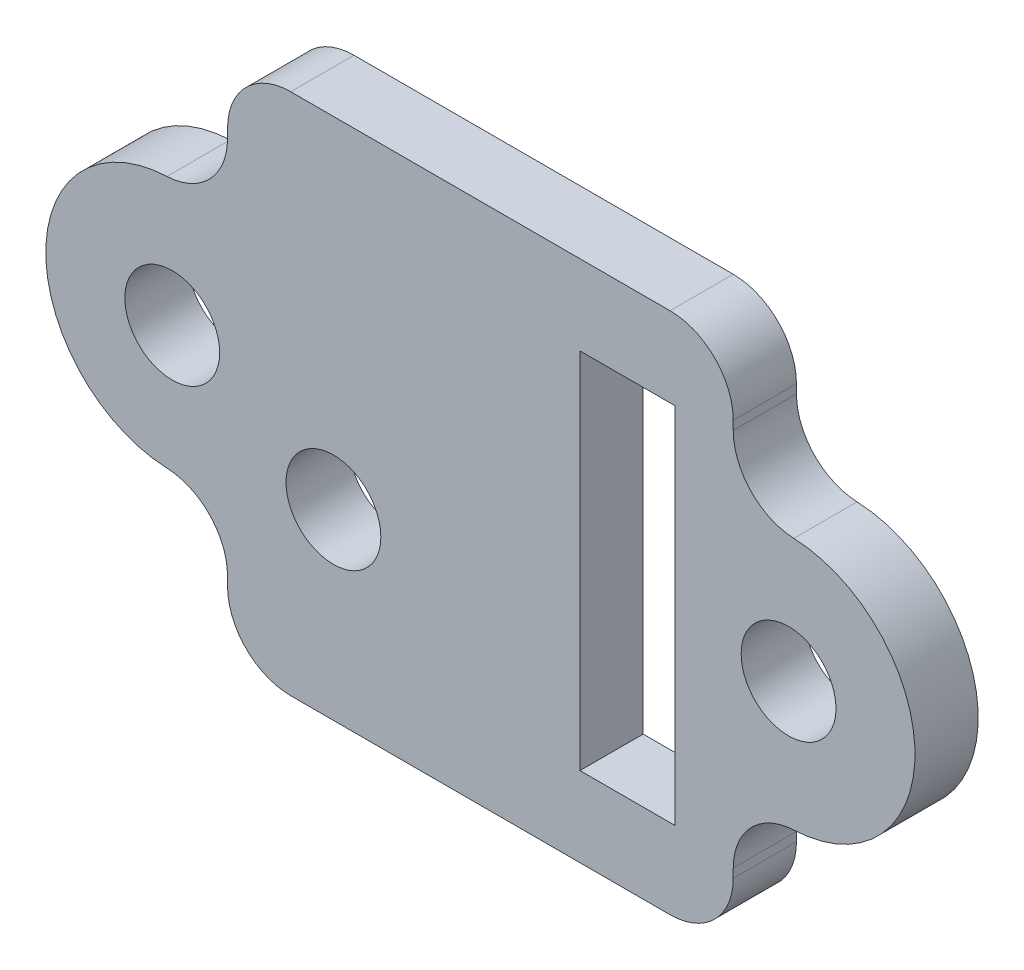
ISO-10303-21;
HEADER;
FILE_DESCRIPTION(('STEP AP214'),'2;1');
FILE_NAME('part.step','',(''),(''),'','','');
FILE_SCHEMA(('AUTOMOTIVE_DESIGN { 1 0 10303 214 1 1 1 1 }'));
ENDSEC;
DATA;
#1=APPLICATION_CONTEXT('core data for automotive mechanical design processes');
#2=APPLICATION_PROTOCOL_DEFINITION('international standard','automotive_design',2000,#1);
#3=PRODUCT_CONTEXT('',#1,'mechanical');
#4=PRODUCT('Part','Part','',(#3));
#5=PRODUCT_RELATED_PRODUCT_CATEGORY('part','',(#4));
#6=PRODUCT_DEFINITION_FORMATION('','',#4);
#7=PRODUCT_DEFINITION_CONTEXT('part definition',#1,'design');
#8=PRODUCT_DEFINITION('design','',#6,#7);
#9=PRODUCT_DEFINITION_SHAPE('','',#8);
#10=(LENGTH_UNIT() NAMED_UNIT(*) SI_UNIT(.MILLI.,.METRE.));
#11=(NAMED_UNIT(*) PLANE_ANGLE_UNIT() SI_UNIT($,.RADIAN.));
#12=(NAMED_UNIT(*) SI_UNIT($,.STERADIAN.) SOLID_ANGLE_UNIT());
#13=UNCERTAINTY_MEASURE_WITH_UNIT(LENGTH_MEASURE(1.E-05),#10,'distance_accuracy_value','');
#14=(GEOMETRIC_REPRESENTATION_CONTEXT(3) GLOBAL_UNCERTAINTY_ASSIGNED_CONTEXT((#13)) GLOBAL_UNIT_ASSIGNED_CONTEXT((#10,
#11,#12)) REPRESENTATION_CONTEXT('',''));
#15=CARTESIAN_POINT('',(0.,0.,0.));
#16=DIRECTION('',(0.,0.,1.));
#17=DIRECTION('',(1.,0.,0.));
#18=AXIS2_PLACEMENT_3D('',#15,#16,#17);
#19=CARTESIAN_POINT('',(-8.,-8.275,1.));
#20=DIRECTION('',(1.,0.,0.));
#21=DIRECTION('',(0.,0.,-1.));
#22=AXIS2_PLACEMENT_3D('',#19,#20,#21);
#23=PLANE('',#22);
#24=DIRECTION('',(0.,-1.,0.));
#25=VECTOR('',#24,1.);
#26=CARTESIAN_POINT('',(-8.,-8.275,1.));
#27=LINE('',#26,#25);
#28=CARTESIAN_POINT('',(-8.,6.275,1.));
#29=VERTEX_POINT('',#28);
#30=CARTESIAN_POINT('',(-8.,5.9947894041409,1.));
#31=VERTEX_POINT('',#30);
#32=EDGE_CURVE('E250',#29,#31,#27,.T.);
#33=ORIENTED_EDGE('',*,*,#32,.F.);
#34=DIRECTION('',(0.,0.,-1.));
#35=VECTOR('',#34,1.);
#36=CARTESIAN_POINT('',(-8.,6.275,1.));
#37=LINE('',#36,#35);
#38=CARTESIAN_POINT('',(-8.,6.275,-1.));
#39=VERTEX_POINT('',#38);
#40=EDGE_CURVE('E325',#29,#39,#37,.T.);
#41=ORIENTED_EDGE('',*,*,#40,.T.);
#42=DIRECTION('',(0.,-1.,0.));
#43=VECTOR('',#42,1.);
#44=CARTESIAN_POINT('',(-8.,-8.275,-1.));
#45=LINE('',#44,#43);
#46=CARTESIAN_POINT('',(-8.,5.9947894041409,-1.));
#47=VERTEX_POINT('',#46);
#48=EDGE_CURVE('E265',#39,#47,#45,.T.);
#49=ORIENTED_EDGE('',*,*,#48,.T.);
#50=DIRECTION('',(0.,0.,1.));
#51=VECTOR('',#50,1.);
#52=CARTESIAN_POINT('',(-8.,5.9947894041409,1.));
#53=LINE('',#52,#51);
#54=EDGE_CURVE('E323',#47,#31,#53,.T.);
#55=ORIENTED_EDGE('',*,*,#54,.T.);
#56=EDGE_LOOP('',(#33,#41,#49,#55));
#57=FACE_BOUND('',#56,.T.);
#58=ADVANCED_FACE('F38',(#57),#23,.F.);
#59=CARTESIAN_POINT('',(8.,-8.275,1.));
#60=DIRECTION('',(-1.,0.,0.));
#61=DIRECTION('',(0.,0.,1.));
#62=AXIS2_PLACEMENT_3D('',#59,#60,#61);
#63=PLANE('',#62);
#64=DIRECTION('',(0.,1.,0.));
#65=VECTOR('',#64,1.);
#66=CARTESIAN_POINT('',(8.,-8.275,1.));
#67=LINE('',#66,#65);
#68=CARTESIAN_POINT('',(8.,-6.275,1.));
#69=VERTEX_POINT('',#68);
#70=CARTESIAN_POINT('',(8.,-5.9947894041409,1.));
#71=VERTEX_POINT('',#70);
#72=EDGE_CURVE('E259',#69,#71,#67,.T.);
#73=ORIENTED_EDGE('',*,*,#72,.F.);
#74=DIRECTION('',(0.,0.,-1.));
#75=VECTOR('',#74,1.);
#76=CARTESIAN_POINT('',(8.,-6.275,1.));
#77=LINE('',#76,#75);
#78=CARTESIAN_POINT('',(8.,-6.275,-1.));
#79=VERTEX_POINT('',#78);
#80=EDGE_CURVE('E306',#69,#79,#77,.T.);
#81=ORIENTED_EDGE('',*,*,#80,.T.);
#82=DIRECTION('',(0.,1.,0.));
#83=VECTOR('',#82,1.);
#84=CARTESIAN_POINT('',(8.,-8.275,-1.));
#85=LINE('',#84,#83);
#86=CARTESIAN_POINT('',(8.,-5.9947894041409,-1.));
#87=VERTEX_POINT('',#86);
#88=EDGE_CURVE('E270',#79,#87,#85,.T.);
#89=ORIENTED_EDGE('',*,*,#88,.T.);
#90=DIRECTION('',(0.,0.,1.));
#91=VECTOR('',#90,1.);
#92=CARTESIAN_POINT('',(8.,-5.9947894041409,1.));
#93=LINE('',#92,#91);
#94=EDGE_CURVE('E304',#87,#71,#93,.T.);
#95=ORIENTED_EDGE('',*,*,#94,.T.);
#96=EDGE_LOOP('',(#73,#81,#89,#95));
#97=FACE_BOUND('',#96,.T.);
#98=ADVANCED_FACE('F384',(#97),#63,.F.);
#99=CARTESIAN_POINT('',(-8.,-5.9947894041409,-1.));
#100=VERTEX_POINT('',#99);
#101=CARTESIAN_POINT('',(-8.,-6.275,-1.));
#102=VERTEX_POINT('',#101);
#103=EDGE_CURVE('E247',#100,#102,#45,.T.);
#104=ORIENTED_EDGE('',*,*,#103,.T.);
#105=DIRECTION('',(0.,0.,-1.));
#106=VECTOR('',#105,1.);
#107=CARTESIAN_POINT('',(-8.,-6.275,1.));
#108=LINE('',#107,#106);
#109=CARTESIAN_POINT('',(-8.,-6.275,1.));
#110=VERTEX_POINT('',#109);
#111=EDGE_CURVE('E290',#102,#110,#108,.F.);
#112=ORIENTED_EDGE('',*,*,#111,.T.);
#113=CARTESIAN_POINT('',(-8.,-5.9947894041409,1.));
#114=VERTEX_POINT('',#113);
#115=EDGE_CURVE('E254',#114,#110,#27,.T.);
#116=ORIENTED_EDGE('',*,*,#115,.F.);
#117=DIRECTION('',(0.,0.,1.));
#118=VECTOR('',#117,1.);
#119=CARTESIAN_POINT('',(-8.,-5.9947894041409,-1.));
#120=LINE('',#119,#118);
#121=EDGE_CURVE('E287',#114,#100,#120,.F.);
#122=ORIENTED_EDGE('',*,*,#121,.T.);
#123=EDGE_LOOP('',(#104,#112,#116,#122));
#124=FACE_BOUND('',#123,.T.);
#125=ADVANCED_FACE('F366',(#124),#23,.F.);
#126=CARTESIAN_POINT('',(8.,-8.275,1.));
#127=DIRECTION('',(0.,1.,0.));
#128=DIRECTION('',(-1.,0.,0.));
#129=AXIS2_PLACEMENT_3D('',#126,#127,#128);
#130=PLANE('',#129);
#131=DIRECTION('',(1.,0.,0.));
#132=VECTOR('',#131,1.);
#133=CARTESIAN_POINT('',(8.,-8.275,1.));
#134=LINE('',#133,#132);
#135=CARTESIAN_POINT('',(-6.,-8.275,1.));
#136=VERTEX_POINT('',#135);
#137=CARTESIAN_POINT('',(6.,-8.275,1.));
#138=VERTEX_POINT('',#137);
#139=EDGE_CURVE('E253',#136,#138,#134,.T.);
#140=ORIENTED_EDGE('',*,*,#139,.F.);
#141=DIRECTION('',(0.,0.,-1.));
#142=VECTOR('',#141,1.);
#143=CARTESIAN_POINT('',(-6.,-8.275,1.));
#144=LINE('',#143,#142);
#145=CARTESIAN_POINT('',(-6.,-8.275,-1.));
#146=VERTEX_POINT('',#145);
#147=EDGE_CURVE('E276',#136,#146,#144,.T.);
#148=ORIENTED_EDGE('',*,*,#147,.T.);
#149=DIRECTION('',(1.,0.,0.));
#150=VECTOR('',#149,1.);
#151=CARTESIAN_POINT('',(8.,-8.275,-1.));
#152=LINE('',#151,#150);
#153=CARTESIAN_POINT('',(6.,-8.275,-1.));
#154=VERTEX_POINT('',#153);
#155=EDGE_CURVE('E266',#146,#154,#152,.T.);
#156=ORIENTED_EDGE('',*,*,#155,.T.);
#157=DIRECTION('',(0.,0.,-1.));
#158=VECTOR('',#157,1.);
#159=CARTESIAN_POINT('',(6.,-8.275,1.));
#160=LINE('',#159,#158);
#161=EDGE_CURVE('E262',#154,#138,#160,.F.);
#162=ORIENTED_EDGE('',*,*,#161,.T.);
#163=EDGE_LOOP('',(#140,#148,#156,#162));
#164=FACE_BOUND('',#163,.T.);
#165=ADVANCED_FACE('F375',(#164),#130,.F.);
#166=CARTESIAN_POINT('',(8.,5.9947894041409,1.));
#167=VERTEX_POINT('',#166);
#168=CARTESIAN_POINT('',(8.,6.275,1.));
#169=VERTEX_POINT('',#168);
#170=EDGE_CURVE('E257',#167,#169,#67,.T.);
#171=ORIENTED_EDGE('',*,*,#170,.F.);
#172=DIRECTION('',(0.,0.,1.));
#173=VECTOR('',#172,1.);
#174=CARTESIAN_POINT('',(8.,5.9947894041409,-1.));
#175=LINE('',#174,#173);
#176=CARTESIAN_POINT('',(8.,5.9947894041409,-1.));
#177=VERTEX_POINT('',#176);
#178=EDGE_CURVE('E316',#167,#177,#175,.F.);
#179=ORIENTED_EDGE('',*,*,#178,.T.);
#180=CARTESIAN_POINT('',(8.,6.275,-1.));
#181=VERTEX_POINT('',#180);
#182=EDGE_CURVE('E269',#177,#181,#85,.T.);
#183=ORIENTED_EDGE('',*,*,#182,.T.);
#184=DIRECTION('',(0.,0.,-1.));
#185=VECTOR('',#184,1.);
#186=CARTESIAN_POINT('',(8.,6.275,1.));
#187=LINE('',#186,#185);
#188=EDGE_CURVE('E314',#181,#169,#187,.F.);
#189=ORIENTED_EDGE('',*,*,#188,.T.);
#190=EDGE_LOOP('',(#171,#179,#183,#189));
#191=FACE_BOUND('',#190,.T.);
#192=ADVANCED_FACE('F401',(#191),#63,.F.);
#193=CARTESIAN_POINT('',(8.,8.275,1.));
#194=DIRECTION('',(0.,-1.,0.));
#195=DIRECTION('',(1.,0.,0.));
#196=AXIS2_PLACEMENT_3D('',#193,#194,#195);
#197=PLANE('',#196);
#198=DIRECTION('',(-1.,0.,0.));
#199=VECTOR('',#198,1.);
#200=CARTESIAN_POINT('',(8.,8.275,1.));
#201=LINE('',#200,#199);
#202=CARTESIAN_POINT('',(6.,8.275,1.));
#203=VERTEX_POINT('',#202);
#204=CARTESIAN_POINT('',(-6.,8.275,1.));
#205=VERTEX_POINT('',#204);
#206=EDGE_CURVE('E260',#203,#205,#201,.T.);
#207=ORIENTED_EDGE('',*,*,#206,.F.);
#208=DIRECTION('',(0.,0.,-1.));
#209=VECTOR('',#208,1.);
#210=CARTESIAN_POINT('',(6.,8.275,1.));
#211=LINE('',#210,#209);
#212=CARTESIAN_POINT('',(6.,8.275,-1.));
#213=VERTEX_POINT('',#212);
#214=EDGE_CURVE('E320',#203,#213,#211,.T.);
#215=ORIENTED_EDGE('',*,*,#214,.T.);
#216=DIRECTION('',(-1.,0.,0.));
#217=VECTOR('',#216,1.);
#218=CARTESIAN_POINT('',(8.,8.275,-1.));
#219=LINE('',#218,#217);
#220=CARTESIAN_POINT('',(-6.,8.275,-1.));
#221=VERTEX_POINT('',#220);
#222=EDGE_CURVE('E273',#213,#221,#219,.T.);
#223=ORIENTED_EDGE('',*,*,#222,.T.);
#224=DIRECTION('',(0.,0.,-1.));
#225=VECTOR('',#224,1.);
#226=CARTESIAN_POINT('',(-6.,8.275,1.));
#227=LINE('',#226,#225);
#228=EDGE_CURVE('E53',#221,#205,#227,.F.);
#229=ORIENTED_EDGE('',*,*,#228,.T.);
#230=EDGE_LOOP('',(#207,#215,#223,#229));
#231=FACE_BOUND('',#230,.T.);
#232=ADVANCED_FACE('F409',(#231),#197,.F.);
#233=CARTESIAN_POINT('',(0.,0.,1.));
#234=DIRECTION('',(0.,0.,1.));
#235=DIRECTION('',(1.,0.,0.));
#236=AXIS2_PLACEMENT_3D('',#233,#234,#235);
#237=PLANE('',#236);
#238=DIRECTION('',(0.,-1.,0.));
#239=VECTOR('',#238,1.);
#240=CARTESIAN_POINT('',(3.15,5.75,1.));
#241=LINE('',#240,#239);
#242=CARTESIAN_POINT('',(3.15,5.75,1.));
#243=VERTEX_POINT('',#242);
#244=CARTESIAN_POINT('',(3.15,-5.75,1.));
#245=VERTEX_POINT('',#244);
#246=EDGE_CURVE('E196',#243,#245,#241,.T.);
#247=ORIENTED_EDGE('',*,*,#246,.F.);
#248=DIRECTION('',(-1.,0.,0.));
#249=VECTOR('',#248,1.);
#250=CARTESIAN_POINT('',(3.15,5.75,1.));
#251=LINE('',#250,#249);
#252=CARTESIAN_POINT('',(6.15,5.75,1.));
#253=VERTEX_POINT('',#252);
#254=EDGE_CURVE('E201',#253,#243,#251,.T.);
#255=ORIENTED_EDGE('',*,*,#254,.F.);
#256=DIRECTION('',(0.,1.,0.));
#257=VECTOR('',#256,1.);
#258=CARTESIAN_POINT('',(6.15,5.75,1.));
#259=LINE('',#258,#257);
#260=CARTESIAN_POINT('',(6.15,-5.75,1.));
#261=VERTEX_POINT('',#260);
#262=EDGE_CURVE('E180',#261,#253,#259,.T.);
#263=ORIENTED_EDGE('',*,*,#262,.F.);
#264=DIRECTION('',(1.,0.,0.));
#265=VECTOR('',#264,1.);
#266=CARTESIAN_POINT('',(3.15,-5.75,1.));
#267=LINE('',#266,#265);
#268=EDGE_CURVE('E192',#245,#261,#267,.T.);
#269=ORIENTED_EDGE('',*,*,#268,.F.);
#270=EDGE_LOOP('',(#247,#255,#263,#269));
#271=FACE_BOUND('',#270,.T.);
#272=CARTESIAN_POINT('',(-4.65,-2.5,1.));
#273=DIRECTION('',(0.,0.,1.));
#274=DIRECTION('',(1.,0.,0.));
#275=AXIS2_PLACEMENT_3D('',#272,#273,#274);
#276=CIRCLE('',#275,1.5);
#277=CARTESIAN_POINT('',(-3.15,-2.5,1.));
#278=VERTEX_POINT('',#277);
#279=EDGE_CURVE('E220',#278,#278,#276,.T.);
#280=ORIENTED_EDGE('',*,*,#279,.F.);
#281=EDGE_LOOP('',(#280));
#282=FACE_BOUND('',#281,.T.);
#283=ORIENTED_EDGE('',*,*,#115,.T.);
#284=CARTESIAN_POINT('',(-6.,-6.275,1.));
#285=DIRECTION('',(0.,0.,1.));
#286=DIRECTION('',(1.,0.,0.));
#287=AXIS2_PLACEMENT_3D('',#284,#285,#286);
#288=CIRCLE('',#287,2.);
#289=EDGE_CURVE('E297',#110,#136,#288,.T.);
#290=ORIENTED_EDGE('',*,*,#289,.T.);
#291=ORIENTED_EDGE('',*,*,#139,.T.);
#292=CARTESIAN_POINT('',(6.,-6.275,1.));
#293=DIRECTION('',(0.,0.,1.));
#294=DIRECTION('',(1.,0.,0.));
#295=AXIS2_PLACEMENT_3D('',#292,#293,#294);
#296=CIRCLE('',#295,2.);
#297=EDGE_CURVE('E295',#138,#69,#296,.T.);
#298=ORIENTED_EDGE('',*,*,#297,.T.);
#299=ORIENTED_EDGE('',*,*,#72,.T.);
#300=CARTESIAN_POINT('',(10.,-5.9947894041409,1.));
#301=DIRECTION('',(0.,0.,1.));
#302=DIRECTION('',(1.,0.,0.));
#303=AXIS2_PLACEMENT_3D('',#300,#301,#302);
#304=CIRCLE('',#303,2.);
#305=CARTESIAN_POINT('',(9.91666666666667,-3.99652626942727,1.));
#306=VERTEX_POINT('',#305);
#307=EDGE_CURVE('E334',#71,#306,#304,.F.);
#308=ORIENTED_EDGE('',*,*,#307,.T.);
#309=CARTESIAN_POINT('',(9.75,0.,1.));
#310=DIRECTION('',(0.,0.,1.));
#311=DIRECTION('',(-1.,0.,0.));
#312=AXIS2_PLACEMENT_3D('',#309,#310,#311);
#313=CIRCLE('',#312,4.);
#314=CARTESIAN_POINT('',(9.91666666666667,3.99652626942727,1.));
#315=VERTEX_POINT('',#314);
#316=EDGE_CURVE('E244',#306,#315,#313,.T.);
#317=ORIENTED_EDGE('',*,*,#316,.T.);
#318=CARTESIAN_POINT('',(10.,5.9947894041409,1.));
#319=DIRECTION('',(0.,0.,1.));
#320=DIRECTION('',(1.,0.,0.));
#321=AXIS2_PLACEMENT_3D('',#318,#319,#320);
#322=CIRCLE('',#321,2.);
#323=EDGE_CURVE('E338',#315,#167,#322,.F.);
#324=ORIENTED_EDGE('',*,*,#323,.T.);
#325=ORIENTED_EDGE('',*,*,#170,.T.);
#326=CARTESIAN_POINT('',(6.,6.275,1.));
#327=DIRECTION('',(0.,0.,1.));
#328=DIRECTION('',(1.,0.,0.));
#329=AXIS2_PLACEMENT_3D('',#326,#327,#328);
#330=CIRCLE('',#329,2.);
#331=EDGE_CURVE('E60',#169,#203,#330,.T.);
#332=ORIENTED_EDGE('',*,*,#331,.T.);
#333=ORIENTED_EDGE('',*,*,#206,.T.);
#334=CARTESIAN_POINT('',(-6.,6.275,1.));
#335=DIRECTION('',(0.,0.,1.));
#336=DIRECTION('',(1.,0.,0.));
#337=AXIS2_PLACEMENT_3D('',#334,#335,#336);
#338=CIRCLE('',#337,2.);
#339=EDGE_CURVE('E292',#205,#29,#338,.T.);
#340=ORIENTED_EDGE('',*,*,#339,.T.);
#341=ORIENTED_EDGE('',*,*,#32,.T.);
#342=CARTESIAN_POINT('',(-10.,5.9947894041409,1.));
#343=DIRECTION('',(0.,0.,1.));
#344=DIRECTION('',(1.,0.,0.));
#345=AXIS2_PLACEMENT_3D('',#342,#343,#344);
#346=CIRCLE('',#345,2.);
#347=CARTESIAN_POINT('',(-9.91666666666667,3.99652626942727,1.));
#348=VERTEX_POINT('',#347);
#349=EDGE_CURVE('E11',#31,#348,#346,.F.);
#350=ORIENTED_EDGE('',*,*,#349,.T.);
#351=CARTESIAN_POINT('',(-9.75,0.,1.));
#352=DIRECTION('',(0.,0.,1.));
#353=DIRECTION('',(1.,0.,0.));
#354=AXIS2_PLACEMENT_3D('',#351,#352,#353);
#355=CIRCLE('',#354,4.);
#356=CARTESIAN_POINT('',(-9.91666666666667,-3.99652626942727,1.));
#357=VERTEX_POINT('',#356);
#358=EDGE_CURVE('E232',#348,#357,#355,.T.);
#359=ORIENTED_EDGE('',*,*,#358,.T.);
#360=CARTESIAN_POINT('',(-10.,-5.9947894041409,1.));
#361=DIRECTION('',(0.,0.,1.));
#362=DIRECTION('',(1.,0.,0.));
#363=AXIS2_PLACEMENT_3D('',#360,#361,#362);
#364=CIRCLE('',#363,2.);
#365=EDGE_CURVE('E330',#357,#114,#364,.F.);
#366=ORIENTED_EDGE('',*,*,#365,.T.);
#367=EDGE_LOOP('',(#283,#290,#291,#298,#299,#308,#317,#324,#325,#332,#333,#340,#341,#350,#359,#366));
#368=FACE_BOUND('',#367,.T.);
#369=CARTESIAN_POINT('',(9.75,0.,1.));
#370=DIRECTION('',(0.,0.,1.));
#371=DIRECTION('',(-1.,0.,0.));
#372=AXIS2_PLACEMENT_3D('',#369,#370,#371);
#373=CIRCLE('',#372,1.5);
#374=CARTESIAN_POINT('',(8.25,0.,1.));
#375=VERTEX_POINT('',#374);
#376=EDGE_CURVE('E238',#375,#375,#373,.T.);
#377=ORIENTED_EDGE('',*,*,#376,.F.);
#378=EDGE_LOOP('',(#377));
#379=FACE_BOUND('',#378,.T.);
#380=CARTESIAN_POINT('',(-9.75,0.,1.));
#381=DIRECTION('',(0.,0.,1.));
#382=DIRECTION('',(1.,0.,0.));
#383=AXIS2_PLACEMENT_3D('',#380,#381,#382);
#384=CIRCLE('',#383,1.5);
#385=CARTESIAN_POINT('',(-8.25,0.,1.));
#386=VERTEX_POINT('',#385);
#387=EDGE_CURVE('E226',#386,#386,#384,.T.);
#388=ORIENTED_EDGE('',*,*,#387,.F.);
#389=EDGE_LOOP('',(#388));
#390=FACE_BOUND('',#389,.T.);
#391=ADVANCED_FACE('F198',(#271,#282,#368,#379,#390),#237,.T.);
#392=CARTESIAN_POINT('',(0.,0.,-1.));
#393=DIRECTION('',(0.,0.,1.));
#394=DIRECTION('',(1.,0.,0.));
#395=AXIS2_PLACEMENT_3D('',#392,#393,#394);
#396=PLANE('',#395);
#397=DIRECTION('',(-1.,0.,0.));
#398=VECTOR('',#397,1.);
#399=CARTESIAN_POINT('',(3.15,5.75,-1.));
#400=LINE('',#399,#398);
#401=CARTESIAN_POINT('',(6.15,5.75,-1.));
#402=VERTEX_POINT('',#401);
#403=CARTESIAN_POINT('',(3.15,5.75,-1.));
#404=VERTEX_POINT('',#403);
#405=EDGE_CURVE('E212',#402,#404,#400,.T.);
#406=ORIENTED_EDGE('',*,*,#405,.T.);
#407=DIRECTION('',(0.,-1.,0.));
#408=VECTOR('',#407,1.);
#409=CARTESIAN_POINT('',(3.15,5.75,-1.));
#410=LINE('',#409,#408);
#411=CARTESIAN_POINT('',(3.15,-5.75,-1.));
#412=VERTEX_POINT('',#411);
#413=EDGE_CURVE('E203',#404,#412,#410,.T.);
#414=ORIENTED_EDGE('',*,*,#413,.T.);
#415=DIRECTION('',(1.,0.,0.));
#416=VECTOR('',#415,1.);
#417=CARTESIAN_POINT('',(3.15,-5.75,-1.));
#418=LINE('',#417,#416);
#419=CARTESIAN_POINT('',(6.15,-5.75,-1.));
#420=VERTEX_POINT('',#419);
#421=EDGE_CURVE('E209',#412,#420,#418,.T.);
#422=ORIENTED_EDGE('',*,*,#421,.T.);
#423=DIRECTION('',(0.,1.,0.));
#424=VECTOR('',#423,1.);
#425=CARTESIAN_POINT('',(6.15,5.75,-1.));
#426=LINE('',#425,#424);
#427=EDGE_CURVE('E183',#420,#402,#426,.T.);
#428=ORIENTED_EDGE('',*,*,#427,.T.);
#429=EDGE_LOOP('',(#406,#414,#422,#428));
#430=FACE_BOUND('',#429,.T.);
#431=CARTESIAN_POINT('',(-4.65,-2.5,-1.));
#432=DIRECTION('',(0.,0.,1.));
#433=DIRECTION('',(1.,0.,0.));
#434=AXIS2_PLACEMENT_3D('',#431,#432,#433);
#435=CIRCLE('',#434,1.5);
#436=CARTESIAN_POINT('',(-3.15,-2.5,-1.));
#437=VERTEX_POINT('',#436);
#438=EDGE_CURVE('E223',#437,#437,#435,.T.);
#439=ORIENTED_EDGE('',*,*,#438,.T.);
#440=EDGE_LOOP('',(#439));
#441=FACE_BOUND('',#440,.T.);
#442=ORIENTED_EDGE('',*,*,#155,.F.);
#443=CARTESIAN_POINT('',(-6.,-6.275,-1.));
#444=DIRECTION('',(0.,0.,1.));
#445=DIRECTION('',(1.,0.,0.));
#446=AXIS2_PLACEMENT_3D('',#443,#444,#445);
#447=CIRCLE('',#446,2.);
#448=EDGE_CURVE('E285',#146,#102,#447,.F.);
#449=ORIENTED_EDGE('',*,*,#448,.T.);
#450=ORIENTED_EDGE('',*,*,#103,.F.);
#451=CARTESIAN_POINT('',(-10.,-5.9947894041409,-1.));
#452=DIRECTION('',(0.,0.,1.));
#453=DIRECTION('',(1.,0.,0.));
#454=AXIS2_PLACEMENT_3D('',#451,#452,#453);
#455=CIRCLE('',#454,2.);
#456=CARTESIAN_POINT('',(-9.91666666666667,-3.99652626942727,-1.));
#457=VERTEX_POINT('',#456);
#458=EDGE_CURVE('E328',#100,#457,#455,.T.);
#459=ORIENTED_EDGE('',*,*,#458,.T.);
#460=CARTESIAN_POINT('',(-9.75,0.,-1.));
#461=DIRECTION('',(0.,0.,1.));
#462=DIRECTION('',(1.,0.,0.));
#463=AXIS2_PLACEMENT_3D('',#460,#461,#462);
#464=CIRCLE('',#463,4.);
#465=CARTESIAN_POINT('',(-9.91666666666667,3.99652626942727,-1.));
#466=VERTEX_POINT('',#465);
#467=EDGE_CURVE('E229',#466,#457,#464,.T.);
#468=ORIENTED_EDGE('',*,*,#467,.F.);
#469=CARTESIAN_POINT('',(-10.,5.9947894041409,-1.));
#470=DIRECTION('',(0.,0.,1.));
#471=DIRECTION('',(1.,0.,0.));
#472=AXIS2_PLACEMENT_3D('',#469,#470,#471);
#473=CIRCLE('',#472,2.);
#474=EDGE_CURVE('E46',#466,#47,#473,.T.);
#475=ORIENTED_EDGE('',*,*,#474,.T.);
#476=ORIENTED_EDGE('',*,*,#48,.F.);
#477=CARTESIAN_POINT('',(-6.,6.275,-1.));
#478=DIRECTION('',(0.,0.,1.));
#479=DIRECTION('',(1.,0.,0.));
#480=AXIS2_PLACEMENT_3D('',#477,#478,#479);
#481=CIRCLE('',#480,2.);
#482=EDGE_CURVE('E279',#39,#221,#481,.F.);
#483=ORIENTED_EDGE('',*,*,#482,.T.);
#484=ORIENTED_EDGE('',*,*,#222,.F.);
#485=CARTESIAN_POINT('',(6.,6.275,-1.));
#486=DIRECTION('',(0.,0.,1.));
#487=DIRECTION('',(1.,0.,0.));
#488=AXIS2_PLACEMENT_3D('',#485,#486,#487);
#489=CIRCLE('',#488,2.);
#490=EDGE_CURVE('E281',#213,#181,#489,.F.);
#491=ORIENTED_EDGE('',*,*,#490,.T.);
#492=ORIENTED_EDGE('',*,*,#182,.F.);
#493=CARTESIAN_POINT('',(10.,5.9947894041409,-1.));
#494=DIRECTION('',(0.,0.,1.));
#495=DIRECTION('',(1.,0.,0.));
#496=AXIS2_PLACEMENT_3D('',#493,#494,#495);
#497=CIRCLE('',#496,2.);
#498=CARTESIAN_POINT('',(9.91666666666667,3.99652626942727,-1.));
#499=VERTEX_POINT('',#498);
#500=EDGE_CURVE('E336',#177,#499,#497,.T.);
#501=ORIENTED_EDGE('',*,*,#500,.T.);
#502=CARTESIAN_POINT('',(9.75,0.,-1.));
#503=DIRECTION('',(0.,0.,1.));
#504=DIRECTION('',(-1.,0.,0.));
#505=AXIS2_PLACEMENT_3D('',#502,#503,#504);
#506=CIRCLE('',#505,4.);
#507=CARTESIAN_POINT('',(9.91666666666667,-3.99652626942727,-1.));
#508=VERTEX_POINT('',#507);
#509=EDGE_CURVE('E241',#508,#499,#506,.T.);
#510=ORIENTED_EDGE('',*,*,#509,.F.);
#511=CARTESIAN_POINT('',(10.,-5.9947894041409,-1.));
#512=DIRECTION('',(0.,0.,1.));
#513=DIRECTION('',(1.,0.,0.));
#514=AXIS2_PLACEMENT_3D('',#511,#512,#513);
#515=CIRCLE('',#514,2.);
#516=EDGE_CURVE('E332',#508,#87,#515,.T.);
#517=ORIENTED_EDGE('',*,*,#516,.T.);
#518=ORIENTED_EDGE('',*,*,#88,.F.);
#519=CARTESIAN_POINT('',(6.,-6.275,-1.));
#520=DIRECTION('',(0.,0.,1.));
#521=DIRECTION('',(1.,0.,0.));
#522=AXIS2_PLACEMENT_3D('',#519,#520,#521);
#523=CIRCLE('',#522,2.);
#524=EDGE_CURVE('E283',#79,#154,#523,.F.);
#525=ORIENTED_EDGE('',*,*,#524,.T.);
#526=EDGE_LOOP('',(#442,#449,#450,#459,#468,#475,#476,#483,#484,#491,#492,#501,#510,#517,#518,#525));
#527=FACE_BOUND('',#526,.T.);
#528=CARTESIAN_POINT('',(9.75,0.,-1.));
#529=DIRECTION('',(0.,0.,1.));
#530=DIRECTION('',(-1.,0.,0.));
#531=AXIS2_PLACEMENT_3D('',#528,#529,#530);
#532=CIRCLE('',#531,1.5);
#533=CARTESIAN_POINT('',(8.25,0.,-1.));
#534=VERTEX_POINT('',#533);
#535=EDGE_CURVE('E235',#534,#534,#532,.T.);
#536=ORIENTED_EDGE('',*,*,#535,.T.);
#537=EDGE_LOOP('',(#536));
#538=FACE_BOUND('',#537,.T.);
#539=CARTESIAN_POINT('',(-9.75,0.,-1.));
#540=DIRECTION('',(0.,0.,1.));
#541=DIRECTION('',(1.,0.,0.));
#542=AXIS2_PLACEMENT_3D('',#539,#540,#541);
#543=CIRCLE('',#542,1.5);
#544=CARTESIAN_POINT('',(-8.25,0.,-1.));
#545=VERTEX_POINT('',#544);
#546=EDGE_CURVE('E217',#545,#545,#543,.T.);
#547=ORIENTED_EDGE('',*,*,#546,.T.);
#548=EDGE_LOOP('',(#547));
#549=FACE_BOUND('',#548,.T.);
#550=ADVANCED_FACE('F344',(#430,#441,#527,#538,#549),#396,.F.);
#551=CARTESIAN_POINT('',(9.75,0.,1.));
#552=DIRECTION('',(0.,0.,-1.));
#553=DIRECTION('',(-1.,0.,0.));
#554=AXIS2_PLACEMENT_3D('',#551,#552,#553);
#555=CYLINDRICAL_SURFACE('',#554,4.);
#556=ORIENTED_EDGE('',*,*,#316,.F.);
#557=DIRECTION('',(0.,0.,-1.));
#558=VECTOR('',#557,1.);
#559=CARTESIAN_POINT('',(9.91666666666667,-3.99652626942727,1.));
#560=LINE('',#559,#558);
#561=EDGE_CURVE('E311',#306,#508,#560,.T.);
#562=ORIENTED_EDGE('',*,*,#561,.T.);
#563=ORIENTED_EDGE('',*,*,#509,.T.);
#564=DIRECTION('',(0.,0.,-1.));
#565=VECTOR('',#564,1.);
#566=CARTESIAN_POINT('',(9.91666666666667,3.99652626942727,1.));
#567=LINE('',#566,#565);
#568=EDGE_CURVE('E309',#499,#315,#567,.F.);
#569=ORIENTED_EDGE('',*,*,#568,.T.);
#570=EDGE_LOOP('',(#556,#562,#563,#569));
#571=FACE_BOUND('',#570,.T.);
#572=ADVANCED_FACE('F393',(#571),#555,.T.);
#573=CARTESIAN_POINT('',(9.75,0.,1.));
#574=DIRECTION('',(0.,0.,-1.));
#575=DIRECTION('',(-1.,0.,0.));
#576=AXIS2_PLACEMENT_3D('',#573,#574,#575);
#577=CYLINDRICAL_SURFACE('',#576,1.5);
#578=ORIENTED_EDGE('',*,*,#376,.T.);
#579=EDGE_LOOP('',(#578));
#580=FACE_BOUND('',#579,.T.);
#581=ORIENTED_EDGE('',*,*,#535,.F.);
#582=EDGE_LOOP('',(#581));
#583=FACE_BOUND('',#582,.T.);
#584=ADVANCED_FACE('F444',(#580,#583),#577,.F.);
#585=CARTESIAN_POINT('',(-9.75,0.,1.));
#586=DIRECTION('',(0.,0.,-1.));
#587=DIRECTION('',(-1.,0.,0.));
#588=AXIS2_PLACEMENT_3D('',#585,#586,#587);
#589=CYLINDRICAL_SURFACE('',#588,4.);
#590=ORIENTED_EDGE('',*,*,#467,.T.);
#591=DIRECTION('',(0.,0.,-1.));
#592=VECTOR('',#591,1.);
#593=CARTESIAN_POINT('',(-9.91666666666667,-3.99652626942727,1.));
#594=LINE('',#593,#592);
#595=EDGE_CURVE('E302',#457,#357,#594,.F.);
#596=ORIENTED_EDGE('',*,*,#595,.T.);
#597=ORIENTED_EDGE('',*,*,#358,.F.);
#598=DIRECTION('',(0.,0.,-1.));
#599=VECTOR('',#598,1.);
#600=CARTESIAN_POINT('',(-9.91666666666667,3.99652626942727,1.));
#601=LINE('',#600,#599);
#602=EDGE_CURVE('E299',#348,#466,#601,.T.);
#603=ORIENTED_EDGE('',*,*,#602,.T.);
#604=EDGE_LOOP('',(#590,#596,#597,#603));
#605=FACE_BOUND('',#604,.T.);
#606=ADVANCED_FACE('F358',(#605),#589,.T.);
#607=CARTESIAN_POINT('',(-9.75,0.,1.));
#608=DIRECTION('',(0.,0.,-1.));
#609=DIRECTION('',(-1.,0.,0.));
#610=AXIS2_PLACEMENT_3D('',#607,#608,#609);
#611=CYLINDRICAL_SURFACE('',#610,1.5);
#612=ORIENTED_EDGE('',*,*,#387,.T.);
#613=EDGE_LOOP('',(#612));
#614=FACE_BOUND('',#613,.T.);
#615=ORIENTED_EDGE('',*,*,#546,.F.);
#616=EDGE_LOOP('',(#615));
#617=FACE_BOUND('',#616,.T.);
#618=ADVANCED_FACE('F450',(#614,#617),#611,.F.);
#619=CARTESIAN_POINT('',(-4.65,-2.5,-1.));
#620=DIRECTION('',(0.,0.,1.));
#621=DIRECTION('',(1.,0.,0.));
#622=AXIS2_PLACEMENT_3D('',#619,#620,#621);
#623=CYLINDRICAL_SURFACE('',#622,1.5);
#624=ORIENTED_EDGE('',*,*,#438,.F.);
#625=EDGE_LOOP('',(#624));
#626=FACE_BOUND('',#625,.T.);
#627=ORIENTED_EDGE('',*,*,#279,.T.);
#628=EDGE_LOOP('',(#627));
#629=FACE_BOUND('',#628,.T.);
#630=ADVANCED_FACE('F453',(#626,#629),#623,.F.);
#631=CARTESIAN_POINT('',(3.15,5.75,-1.));
#632=DIRECTION('',(-1.,0.,0.));
#633=DIRECTION('',(0.,0.,1.));
#634=AXIS2_PLACEMENT_3D('',#631,#632,#633);
#635=PLANE('',#634);
#636=DIRECTION('',(0.,0.,1.));
#637=VECTOR('',#636,1.);
#638=CARTESIAN_POINT('',(3.15,-5.75,-1.));
#639=LINE('',#638,#637);
#640=EDGE_CURVE('E188',#412,#245,#639,.T.);
#641=ORIENTED_EDGE('',*,*,#640,.F.);
#642=ORIENTED_EDGE('',*,*,#413,.F.);
#643=DIRECTION('',(0.,0.,1.));
#644=VECTOR('',#643,1.);
#645=CARTESIAN_POINT('',(3.15,5.75,-1.));
#646=LINE('',#645,#644);
#647=EDGE_CURVE('E215',#404,#243,#646,.T.);
#648=ORIENTED_EDGE('',*,*,#647,.T.);
#649=ORIENTED_EDGE('',*,*,#246,.T.);
#650=EDGE_LOOP('',(#641,#642,#648,#649));
#651=FACE_BOUND('',#650,.T.);
#652=ADVANCED_FACE('F457',(#651),#635,.F.);
#653=CARTESIAN_POINT('',(3.15,5.75,-1.));
#654=DIRECTION('',(0.,1.,0.));
#655=DIRECTION('',(0.,0.,1.));
#656=AXIS2_PLACEMENT_3D('',#653,#654,#655);
#657=PLANE('',#656);
#658=ORIENTED_EDGE('',*,*,#647,.F.);
#659=ORIENTED_EDGE('',*,*,#405,.F.);
#660=DIRECTION('',(0.,0.,1.));
#661=VECTOR('',#660,1.);
#662=CARTESIAN_POINT('',(6.15,5.75,-1.));
#663=LINE('',#662,#661);
#664=EDGE_CURVE('E187',#402,#253,#663,.T.);
#665=ORIENTED_EDGE('',*,*,#664,.T.);
#666=ORIENTED_EDGE('',*,*,#254,.T.);
#667=EDGE_LOOP('',(#658,#659,#665,#666));
#668=FACE_BOUND('',#667,.T.);
#669=ADVANCED_FACE('F461',(#668),#657,.F.);
#670=CARTESIAN_POINT('',(6.15,5.75,-1.));
#671=DIRECTION('',(1.,0.,0.));
#672=DIRECTION('',(0.,0.,-1.));
#673=AXIS2_PLACEMENT_3D('',#670,#671,#672);
#674=PLANE('',#673);
#675=ORIENTED_EDGE('',*,*,#664,.F.);
#676=ORIENTED_EDGE('',*,*,#427,.F.);
#677=DIRECTION('',(0.,0.,1.));
#678=VECTOR('',#677,1.);
#679=CARTESIAN_POINT('',(6.15,-5.75,-1.));
#680=LINE('',#679,#678);
#681=EDGE_CURVE('E176',#420,#261,#680,.T.);
#682=ORIENTED_EDGE('',*,*,#681,.T.);
#683=ORIENTED_EDGE('',*,*,#262,.T.);
#684=EDGE_LOOP('',(#675,#676,#682,#683));
#685=FACE_BOUND('',#684,.T.);
#686=ADVANCED_FACE('F178',(#685),#674,.F.);
#687=CARTESIAN_POINT('',(3.15,-5.75,-1.));
#688=DIRECTION('',(0.,-1.,0.));
#689=DIRECTION('',(0.,0.,-1.));
#690=AXIS2_PLACEMENT_3D('',#687,#688,#689);
#691=PLANE('',#690);
#692=ORIENTED_EDGE('',*,*,#681,.F.);
#693=ORIENTED_EDGE('',*,*,#421,.F.);
#694=ORIENTED_EDGE('',*,*,#640,.T.);
#695=ORIENTED_EDGE('',*,*,#268,.T.);
#696=EDGE_LOOP('',(#692,#693,#694,#695));
#697=FACE_BOUND('',#696,.T.);
#698=ADVANCED_FACE('F193',(#697),#691,.F.);
#699=CARTESIAN_POINT('',(-6.,-6.275,1.));
#700=DIRECTION('',(0.,0.,-1.));
#701=DIRECTION('',(-1.,0.,0.));
#702=AXIS2_PLACEMENT_3D('',#699,#700,#701);
#703=CYLINDRICAL_SURFACE('',#702,2.);
#704=ORIENTED_EDGE('',*,*,#289,.F.);
#705=ORIENTED_EDGE('',*,*,#111,.F.);
#706=ORIENTED_EDGE('',*,*,#448,.F.);
#707=ORIENTED_EDGE('',*,*,#147,.F.);
#708=EDGE_LOOP('',(#704,#705,#706,#707));
#709=FACE_BOUND('',#708,.T.);
#710=ADVANCED_FACE('F370',(#709),#703,.T.);
#711=CARTESIAN_POINT('',(-10.,-5.9947894041409,1.));
#712=DIRECTION('',(0.,0.,-1.));
#713=DIRECTION('',(-1.,0.,0.));
#714=AXIS2_PLACEMENT_3D('',#711,#712,#713);
#715=CYLINDRICAL_SURFACE('',#714,2.);
#716=ORIENTED_EDGE('',*,*,#365,.F.);
#717=ORIENTED_EDGE('',*,*,#595,.F.);
#718=ORIENTED_EDGE('',*,*,#458,.F.);
#719=ORIENTED_EDGE('',*,*,#121,.F.);
#720=EDGE_LOOP('',(#716,#717,#718,#719));
#721=FACE_BOUND('',#720,.T.);
#722=ADVANCED_FACE('F361',(#721),#715,.F.);
#723=CARTESIAN_POINT('',(6.,-6.275,1.));
#724=DIRECTION('',(0.,0.,-1.));
#725=DIRECTION('',(-1.,0.,0.));
#726=AXIS2_PLACEMENT_3D('',#723,#724,#725);
#727=CYLINDRICAL_SURFACE('',#726,2.);
#728=ORIENTED_EDGE('',*,*,#297,.F.);
#729=ORIENTED_EDGE('',*,*,#161,.F.);
#730=ORIENTED_EDGE('',*,*,#524,.F.);
#731=ORIENTED_EDGE('',*,*,#80,.F.);
#732=EDGE_LOOP('',(#728,#729,#730,#731));
#733=FACE_BOUND('',#732,.T.);
#734=ADVANCED_FACE('F378',(#733),#727,.T.);
#735=CARTESIAN_POINT('',(10.,-5.9947894041409,1.));
#736=DIRECTION('',(0.,0.,-1.));
#737=DIRECTION('',(-1.,0.,0.));
#738=AXIS2_PLACEMENT_3D('',#735,#736,#737);
#739=CYLINDRICAL_SURFACE('',#738,2.);
#740=ORIENTED_EDGE('',*,*,#307,.F.);
#741=ORIENTED_EDGE('',*,*,#94,.F.);
#742=ORIENTED_EDGE('',*,*,#516,.F.);
#743=ORIENTED_EDGE('',*,*,#561,.F.);
#744=EDGE_LOOP('',(#740,#741,#742,#743));
#745=FACE_BOUND('',#744,.T.);
#746=ADVANCED_FACE('F388',(#745),#739,.F.);
#747=CARTESIAN_POINT('',(10.,5.9947894041409,1.));
#748=DIRECTION('',(0.,0.,-1.));
#749=DIRECTION('',(-1.,0.,0.));
#750=AXIS2_PLACEMENT_3D('',#747,#748,#749);
#751=CYLINDRICAL_SURFACE('',#750,2.);
#752=ORIENTED_EDGE('',*,*,#323,.F.);
#753=ORIENTED_EDGE('',*,*,#568,.F.);
#754=ORIENTED_EDGE('',*,*,#500,.F.);
#755=ORIENTED_EDGE('',*,*,#178,.F.);
#756=EDGE_LOOP('',(#752,#753,#754,#755));
#757=FACE_BOUND('',#756,.T.);
#758=ADVANCED_FACE('F397',(#757),#751,.F.);
#759=CARTESIAN_POINT('',(6.,6.275,1.));
#760=DIRECTION('',(0.,0.,-1.));
#761=DIRECTION('',(-1.,0.,0.));
#762=AXIS2_PLACEMENT_3D('',#759,#760,#761);
#763=CYLINDRICAL_SURFACE('',#762,2.);
#764=ORIENTED_EDGE('',*,*,#331,.F.);
#765=ORIENTED_EDGE('',*,*,#188,.F.);
#766=ORIENTED_EDGE('',*,*,#490,.F.);
#767=ORIENTED_EDGE('',*,*,#214,.F.);
#768=EDGE_LOOP('',(#764,#765,#766,#767));
#769=FACE_BOUND('',#768,.T.);
#770=ADVANCED_FACE('F406',(#769),#763,.T.);
#771=CARTESIAN_POINT('',(-6.,6.275,1.));
#772=DIRECTION('',(0.,0.,-1.));
#773=DIRECTION('',(-1.,0.,0.));
#774=AXIS2_PLACEMENT_3D('',#771,#772,#773);
#775=CYLINDRICAL_SURFACE('',#774,2.);
#776=ORIENTED_EDGE('',*,*,#339,.F.);
#777=ORIENTED_EDGE('',*,*,#228,.F.);
#778=ORIENTED_EDGE('',*,*,#482,.F.);
#779=ORIENTED_EDGE('',*,*,#40,.F.);
#780=EDGE_LOOP('',(#776,#777,#778,#779));
#781=FACE_BOUND('',#780,.T.);
#782=ADVANCED_FACE('F412',(#781),#775,.T.);
#783=CARTESIAN_POINT('',(-10.,5.9947894041409,1.));
#784=DIRECTION('',(0.,0.,-1.));
#785=DIRECTION('',(-1.,0.,0.));
#786=AXIS2_PLACEMENT_3D('',#783,#784,#785);
#787=CYLINDRICAL_SURFACE('',#786,2.);
#788=ORIENTED_EDGE('',*,*,#349,.F.);
#789=ORIENTED_EDGE('',*,*,#54,.F.);
#790=ORIENTED_EDGE('',*,*,#474,.F.);
#791=ORIENTED_EDGE('',*,*,#602,.F.);
#792=EDGE_LOOP('',(#788,#789,#790,#791));
#793=FACE_BOUND('',#792,.T.);
#794=ADVANCED_FACE('F40',(#793),#787,.F.);
#795=CLOSED_SHELL('',(#58,#98,#125,#165,#192,#232,#391,#550,#572,#584,#606,#618,#630,#652,#669,
#686,#698,#710,#722,#734,#746,#758,#770,#782,#794));
#796=MANIFOLD_SOLID_BREP('B2',#795);
#797=ADVANCED_BREP_SHAPE_REPRESENTATION('',(#18,#796),#14);
#798=SHAPE_DEFINITION_REPRESENTATION(#9,#797);
ENDSEC;
END-ISO-10303-21;
